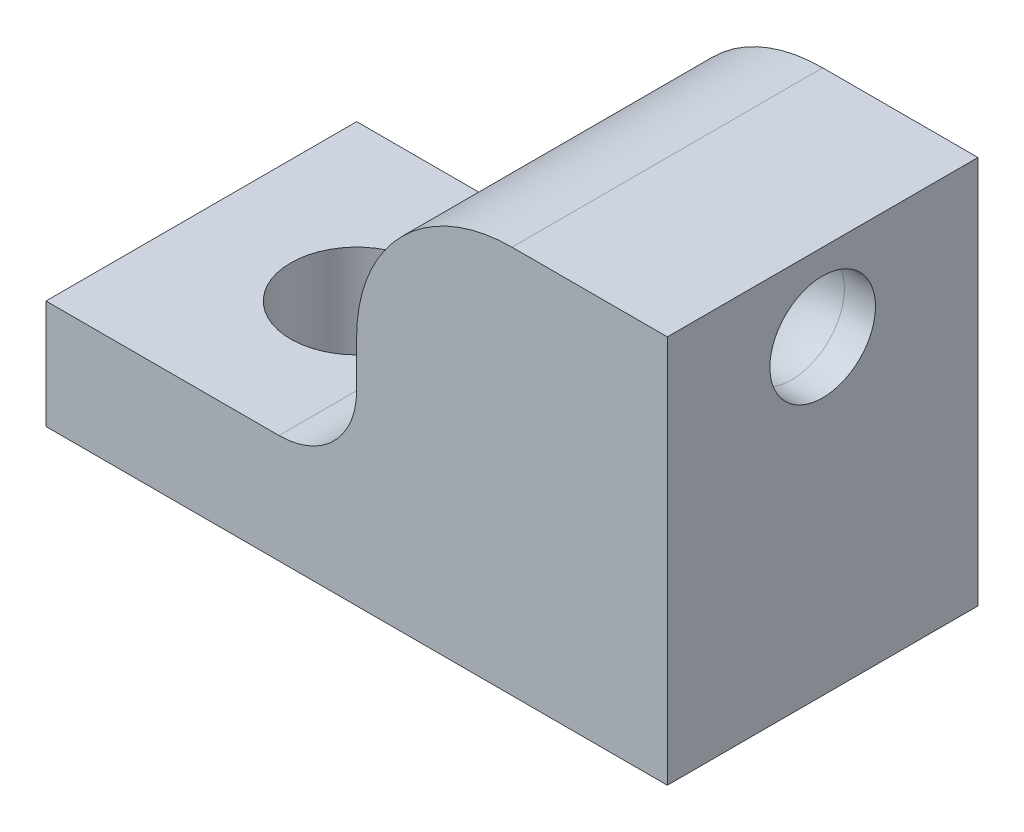
ISO-10303-21;
HEADER;
FILE_DESCRIPTION(('STEP AP214'),'2;1');
FILE_NAME('part.step','',(''),(''),'','','');
FILE_SCHEMA(('AUTOMOTIVE_DESIGN { 1 0 10303 214 1 1 1 1 }'));
ENDSEC;
DATA;
#1=APPLICATION_CONTEXT('core data for automotive mechanical design processes');
#2=APPLICATION_PROTOCOL_DEFINITION('international standard','automotive_design',2000,#1);
#3=PRODUCT_CONTEXT('',#1,'mechanical');
#4=PRODUCT('Part','Part','',(#3));
#5=PRODUCT_RELATED_PRODUCT_CATEGORY('part','',(#4));
#6=PRODUCT_DEFINITION_FORMATION('','',#4);
#7=PRODUCT_DEFINITION_CONTEXT('part definition',#1,'design');
#8=PRODUCT_DEFINITION('design','',#6,#7);
#9=PRODUCT_DEFINITION_SHAPE('','',#8);
#10=(LENGTH_UNIT() NAMED_UNIT(*) SI_UNIT(.MILLI.,.METRE.));
#11=(NAMED_UNIT(*) PLANE_ANGLE_UNIT() SI_UNIT($,.RADIAN.));
#12=(NAMED_UNIT(*) SI_UNIT($,.STERADIAN.) SOLID_ANGLE_UNIT());
#13=UNCERTAINTY_MEASURE_WITH_UNIT(LENGTH_MEASURE(1.E-05),#10,'distance_accuracy_value','');
#14=(GEOMETRIC_REPRESENTATION_CONTEXT(3) GLOBAL_UNCERTAINTY_ASSIGNED_CONTEXT((#13)) GLOBAL_UNIT_ASSIGNED_CONTEXT((#10,
#11,#12)) REPRESENTATION_CONTEXT('',''));
#15=CARTESIAN_POINT('',(0.,0.,0.));
#16=DIRECTION('',(0.,0.,1.));
#17=DIRECTION('',(1.,0.,0.));
#18=AXIS2_PLACEMENT_3D('',#15,#16,#17);
#19=CARTESIAN_POINT('',(0.,0.,10.));
#20=DIRECTION('',(0.,0.,1.));
#21=DIRECTION('',(1.,0.,0.));
#22=AXIS2_PLACEMENT_3D('',#19,#20,#21);
#23=PLANE('',#22);
#24=DIRECTION('',(-1.,0.,0.));
#25=VECTOR('',#24,1.);
#26=CARTESIAN_POINT('',(20.,25.,10.));
#27=LINE('',#26,#25);
#28=CARTESIAN_POINT('',(20.,25.,10.));
#29=VERTEX_POINT('',#28);
#30=CARTESIAN_POINT('',(10.,25.,10.));
#31=VERTEX_POINT('',#30);
#32=EDGE_CURVE('E158',#29,#31,#27,.T.);
#33=ORIENTED_EDGE('',*,*,#32,.T.);
#34=CARTESIAN_POINT('',(10.,15.,10.));
#35=DIRECTION('',(0.,0.,1.));
#36=DIRECTION('',(1.,0.,0.));
#37=AXIS2_PLACEMENT_3D('',#34,#35,#36);
#38=CIRCLE('',#37,10.);
#39=CARTESIAN_POINT('',(0.,15.,10.));
#40=VERTEX_POINT('',#39);
#41=EDGE_CURVE('E12',#31,#40,#38,.T.);
#42=ORIENTED_EDGE('',*,*,#41,.T.);
#43=DIRECTION('',(0.,-1.,0.));
#44=VECTOR('',#43,1.);
#45=CARTESIAN_POINT('',(0.,25.,10.));
#46=LINE('',#45,#44);
#47=CARTESIAN_POINT('',(0.,12.,10.));
#48=VERTEX_POINT('',#47);
#49=EDGE_CURVE('E156',#40,#48,#46,.T.);
#50=ORIENTED_EDGE('',*,*,#49,.T.);
#51=CARTESIAN_POINT('',(-5.,12.,10.));
#52=DIRECTION('',(0.,0.,1.));
#53=DIRECTION('',(1.,0.,0.));
#54=AXIS2_PLACEMENT_3D('',#51,#52,#53);
#55=CIRCLE('',#54,5.);
#56=CARTESIAN_POINT('',(-5.,7.,10.));
#57=VERTEX_POINT('',#56);
#58=EDGE_CURVE('E178',#48,#57,#55,.F.);
#59=ORIENTED_EDGE('',*,*,#58,.T.);
#60=DIRECTION('',(1.,0.,0.));
#61=VECTOR('',#60,1.);
#62=CARTESIAN_POINT('',(0.,7.,10.));
#63=LINE('',#62,#61);
#64=CARTESIAN_POINT('',(-20.,7.,10.));
#65=VERTEX_POINT('',#64);
#66=EDGE_CURVE('E135',#65,#57,#63,.T.);
#67=ORIENTED_EDGE('',*,*,#66,.F.);
#68=DIRECTION('',(0.,-1.,0.));
#69=VECTOR('',#68,1.);
#70=CARTESIAN_POINT('',(-20.,0.,10.));
#71=LINE('',#70,#69);
#72=CARTESIAN_POINT('',(-20.,0.,10.));
#73=VERTEX_POINT('',#72);
#74=EDGE_CURVE('E136',#65,#73,#71,.T.);
#75=ORIENTED_EDGE('',*,*,#74,.T.);
#76=DIRECTION('',(1.,0.,0.));
#77=VECTOR('',#76,1.);
#78=CARTESIAN_POINT('',(0.,0.,10.));
#79=LINE('',#78,#77);
#80=CARTESIAN_POINT('',(20.,0.,10.));
#81=VERTEX_POINT('',#80);
#82=EDGE_CURVE('E124',#73,#81,#79,.T.);
#83=ORIENTED_EDGE('',*,*,#82,.T.);
#84=DIRECTION('',(0.,-1.,0.));
#85=VECTOR('',#84,1.);
#86=CARTESIAN_POINT('',(20.,25.,10.));
#87=LINE('',#86,#85);
#88=EDGE_CURVE('E161',#29,#81,#87,.T.);
#89=ORIENTED_EDGE('',*,*,#88,.F.);
#90=EDGE_LOOP('',(#33,#42,#50,#59,#67,#75,#83,#89));
#91=FACE_BOUND('',#90,.T.);
#92=ADVANCED_FACE('F59',(#91),#23,.T.);
#93=CARTESIAN_POINT('',(-20.,0.,10.));
#94=DIRECTION('',(1.,0.,0.));
#95=DIRECTION('',(0.,0.,-1.));
#96=AXIS2_PLACEMENT_3D('',#93,#94,#95);
#97=PLANE('',#96);
#98=DIRECTION('',(0.,-1.,0.));
#99=VECTOR('',#98,1.);
#100=CARTESIAN_POINT('',(-20.,0.,-10.));
#101=LINE('',#100,#99);
#102=CARTESIAN_POINT('',(-20.,7.,-10.));
#103=VERTEX_POINT('',#102);
#104=CARTESIAN_POINT('',(-20.,0.,-10.));
#105=VERTEX_POINT('',#104);
#106=EDGE_CURVE('E146',#103,#105,#101,.T.);
#107=ORIENTED_EDGE('',*,*,#106,.T.);
#108=DIRECTION('',(0.,0.,-1.));
#109=VECTOR('',#108,1.);
#110=CARTESIAN_POINT('',(-20.,0.,10.));
#111=LINE('',#110,#109);
#112=EDGE_CURVE('E128',#73,#105,#111,.T.);
#113=ORIENTED_EDGE('',*,*,#112,.F.);
#114=ORIENTED_EDGE('',*,*,#74,.F.);
#115=DIRECTION('',(0.,0.,-1.));
#116=VECTOR('',#115,1.);
#117=CARTESIAN_POINT('',(-20.,7.,10.));
#118=LINE('',#117,#116);
#119=EDGE_CURVE('E148',#65,#103,#118,.T.);
#120=ORIENTED_EDGE('',*,*,#119,.T.);
#121=EDGE_LOOP('',(#107,#113,#114,#120));
#122=FACE_BOUND('',#121,.T.);
#123=ADVANCED_FACE('F144',(#122),#97,.F.);
#124=CARTESIAN_POINT('',(0.,0.,-10.));
#125=DIRECTION('',(0.,0.,1.));
#126=DIRECTION('',(1.,0.,0.));
#127=AXIS2_PLACEMENT_3D('',#124,#125,#126);
#128=PLANE('',#127);
#129=DIRECTION('',(0.,-1.,0.));
#130=VECTOR('',#129,1.);
#131=CARTESIAN_POINT('',(0.,25.,-10.));
#132=LINE('',#131,#130);
#133=CARTESIAN_POINT('',(0.,15.,-10.));
#134=VERTEX_POINT('',#133);
#135=CARTESIAN_POINT('',(0.,12.,-10.));
#136=VERTEX_POINT('',#135);
#137=EDGE_CURVE('E164',#134,#136,#132,.T.);
#138=ORIENTED_EDGE('',*,*,#137,.F.);
#139=CARTESIAN_POINT('',(10.,15.,-10.));
#140=DIRECTION('',(0.,0.,1.));
#141=DIRECTION('',(1.,0.,0.));
#142=AXIS2_PLACEMENT_3D('',#139,#140,#141);
#143=CIRCLE('',#142,10.);
#144=CARTESIAN_POINT('',(10.,25.,-10.));
#145=VERTEX_POINT('',#144);
#146=EDGE_CURVE('E81',#134,#145,#143,.F.);
#147=ORIENTED_EDGE('',*,*,#146,.T.);
#148=DIRECTION('',(-1.,0.,0.));
#149=VECTOR('',#148,1.);
#150=CARTESIAN_POINT('',(20.,25.,-10.));
#151=LINE('',#150,#149);
#152=CARTESIAN_POINT('',(20.,25.,-10.));
#153=VERTEX_POINT('',#152);
#154=EDGE_CURVE('E166',#153,#145,#151,.T.);
#155=ORIENTED_EDGE('',*,*,#154,.F.);
#156=DIRECTION('',(0.,-1.,0.));
#157=VECTOR('',#156,1.);
#158=CARTESIAN_POINT('',(20.,25.,-10.));
#159=LINE('',#158,#157);
#160=CARTESIAN_POINT('',(20.,0.,-10.));
#161=VERTEX_POINT('',#160);
#162=EDGE_CURVE('E159',#153,#161,#159,.T.);
#163=ORIENTED_EDGE('',*,*,#162,.T.);
#164=DIRECTION('',(1.,0.,0.));
#165=VECTOR('',#164,1.);
#166=CARTESIAN_POINT('',(0.,0.,-10.));
#167=LINE('',#166,#165);
#168=EDGE_CURVE('E202',#105,#161,#167,.T.);
#169=ORIENTED_EDGE('',*,*,#168,.F.);
#170=ORIENTED_EDGE('',*,*,#106,.F.);
#171=DIRECTION('',(1.,0.,0.));
#172=VECTOR('',#171,1.);
#173=CARTESIAN_POINT('',(0.,7.,-10.));
#174=LINE('',#173,#172);
#175=CARTESIAN_POINT('',(-5.,7.,-10.));
#176=VERTEX_POINT('',#175);
#177=EDGE_CURVE('E142',#103,#176,#174,.T.);
#178=ORIENTED_EDGE('',*,*,#177,.T.);
#179=CARTESIAN_POINT('',(-5.,12.,-10.));
#180=DIRECTION('',(0.,0.,1.));
#181=DIRECTION('',(1.,0.,0.));
#182=AXIS2_PLACEMENT_3D('',#179,#180,#181);
#183=CIRCLE('',#182,5.);
#184=EDGE_CURVE('E175',#176,#136,#183,.T.);
#185=ORIENTED_EDGE('',*,*,#184,.T.);
#186=EDGE_LOOP('',(#138,#147,#155,#163,#169,#170,#178,#185));
#187=FACE_BOUND('',#186,.T.);
#188=ADVANCED_FACE('F189',(#187),#128,.F.);
#189=CARTESIAN_POINT('',(0.,7.,10.));
#190=DIRECTION('',(0.,1.,0.));
#191=DIRECTION('',(-1.,0.,0.));
#192=AXIS2_PLACEMENT_3D('',#189,#190,#191);
#193=PLANE('',#192);
#194=CARTESIAN_POINT('',(-10.,7.,0.));
#195=DIRECTION('',(0.,1.,0.));
#196=DIRECTION('',(-1.,0.,0.));
#197=AXIS2_PLACEMENT_3D('',#194,#195,#196);
#198=CIRCLE('',#197,4.25);
#199=CARTESIAN_POINT('',(-14.25,7.,0.));
#200=VERTEX_POINT('',#199);
#201=EDGE_CURVE('E251',#200,#200,#198,.T.);
#202=ORIENTED_EDGE('',*,*,#201,.F.);
#203=EDGE_LOOP('',(#202));
#204=FACE_BOUND('',#203,.T.);
#205=ORIENTED_EDGE('',*,*,#66,.T.);
#206=DIRECTION('',(0.,0.,-1.));
#207=VECTOR('',#206,1.);
#208=CARTESIAN_POINT('',(-5.,7.,10.));
#209=LINE('',#208,#207);
#210=EDGE_CURVE('E147',#57,#176,#209,.T.);
#211=ORIENTED_EDGE('',*,*,#210,.T.);
#212=ORIENTED_EDGE('',*,*,#177,.F.);
#213=ORIENTED_EDGE('',*,*,#119,.F.);
#214=EDGE_LOOP('',(#205,#211,#212,#213));
#215=FACE_BOUND('',#214,.T.);
#216=ADVANCED_FACE('F198',(#204,#215),#193,.T.);
#217=CARTESIAN_POINT('',(0.,0.,10.));
#218=DIRECTION('',(0.,1.,0.));
#219=DIRECTION('',(0.,0.,1.));
#220=AXIS2_PLACEMENT_3D('',#217,#218,#219);
#221=PLANE('',#220);
#222=CARTESIAN_POINT('',(9.99999999999999,0.,0.));
#223=DIRECTION('',(0.,1.,0.));
#224=DIRECTION('',(0.,0.,1.));
#225=AXIS2_PLACEMENT_3D('',#222,#223,#224);
#226=CIRCLE('',#225,3.4);
#227=CARTESIAN_POINT('',(9.99999999999999,0.,3.4));
#228=VERTEX_POINT('',#227);
#229=EDGE_CURVE('E262',#228,#228,#226,.T.);
#230=ORIENTED_EDGE('',*,*,#229,.T.);
#231=EDGE_LOOP('',(#230));
#232=FACE_BOUND('',#231,.T.);
#233=CARTESIAN_POINT('',(-10.,0.,0.));
#234=DIRECTION('',(0.,1.,0.));
#235=DIRECTION('',(-1.,0.,0.));
#236=AXIS2_PLACEMENT_3D('',#233,#234,#235);
#237=CIRCLE('',#236,4.25);
#238=CARTESIAN_POINT('',(-14.25,0.,0.));
#239=VERTEX_POINT('',#238);
#240=EDGE_CURVE('E167',#239,#239,#237,.T.);
#241=ORIENTED_EDGE('',*,*,#240,.T.);
#242=EDGE_LOOP('',(#241));
#243=FACE_BOUND('',#242,.T.);
#244=ORIENTED_EDGE('',*,*,#168,.T.);
#245=DIRECTION('',(0.,0.,-1.));
#246=VECTOR('',#245,1.);
#247=CARTESIAN_POINT('',(20.,0.,10.));
#248=LINE('',#247,#246);
#249=EDGE_CURVE('E131',#81,#161,#248,.T.);
#250=ORIENTED_EDGE('',*,*,#249,.F.);
#251=ORIENTED_EDGE('',*,*,#82,.F.);
#252=ORIENTED_EDGE('',*,*,#112,.T.);
#253=EDGE_LOOP('',(#244,#250,#251,#252));
#254=FACE_BOUND('',#253,.T.);
#255=ADVANCED_FACE('F126',(#232,#243,#254),#221,.F.);
#256=CARTESIAN_POINT('',(20.,25.,10.));
#257=DIRECTION('',(1.,0.,0.));
#258=DIRECTION('',(0.,1.,0.));
#259=AXIS2_PLACEMENT_3D('',#256,#257,#258);
#260=PLANE('',#259);
#261=CARTESIAN_POINT('',(20.,20.,0.));
#262=DIRECTION('',(1.,0.,0.));
#263=DIRECTION('',(0.,1.,0.));
#264=AXIS2_PLACEMENT_3D('',#261,#262,#263);
#265=CIRCLE('',#264,3.4);
#266=CARTESIAN_POINT('',(20.,23.4,0.));
#267=VERTEX_POINT('',#266);
#268=EDGE_CURVE('E252',#267,#267,#265,.T.);
#269=ORIENTED_EDGE('',*,*,#268,.F.);
#270=EDGE_LOOP('',(#269));
#271=FACE_BOUND('',#270,.T.);
#272=ORIENTED_EDGE('',*,*,#162,.F.);
#273=DIRECTION('',(0.,0.,-1.));
#274=VECTOR('',#273,1.);
#275=CARTESIAN_POINT('',(20.,25.,10.));
#276=LINE('',#275,#274);
#277=EDGE_CURVE('E163',#29,#153,#276,.T.);
#278=ORIENTED_EDGE('',*,*,#277,.F.);
#279=ORIENTED_EDGE('',*,*,#88,.T.);
#280=ORIENTED_EDGE('',*,*,#249,.T.);
#281=EDGE_LOOP('',(#272,#278,#279,#280));
#282=FACE_BOUND('',#281,.T.);
#283=ADVANCED_FACE('F205',(#271,#282),#260,.T.);
#284=CARTESIAN_POINT('',(20.,25.,10.));
#285=DIRECTION('',(0.,-1.,0.));
#286=DIRECTION('',(1.,0.,0.));
#287=AXIS2_PLACEMENT_3D('',#284,#285,#286);
#288=PLANE('',#287);
#289=ORIENTED_EDGE('',*,*,#154,.T.);
#290=DIRECTION('',(0.,0.,-1.));
#291=VECTOR('',#290,1.);
#292=CARTESIAN_POINT('',(10.,25.,10.));
#293=LINE('',#292,#291);
#294=EDGE_CURVE('E67',#145,#31,#293,.F.);
#295=ORIENTED_EDGE('',*,*,#294,.T.);
#296=ORIENTED_EDGE('',*,*,#32,.F.);
#297=ORIENTED_EDGE('',*,*,#277,.T.);
#298=EDGE_LOOP('',(#289,#295,#296,#297));
#299=FACE_BOUND('',#298,.T.);
#300=ADVANCED_FACE('F206',(#299),#288,.F.);
#301=CARTESIAN_POINT('',(0.,25.,10.));
#302=DIRECTION('',(1.,0.,0.));
#303=DIRECTION('',(0.,1.,0.));
#304=AXIS2_PLACEMENT_3D('',#301,#302,#303);
#305=PLANE('',#304);
#306=ORIENTED_EDGE('',*,*,#49,.F.);
#307=DIRECTION('',(0.,0.,-1.));
#308=VECTOR('',#307,1.);
#309=CARTESIAN_POINT('',(0.,15.,10.));
#310=LINE('',#309,#308);
#311=EDGE_CURVE('E180',#40,#134,#310,.T.);
#312=ORIENTED_EDGE('',*,*,#311,.T.);
#313=ORIENTED_EDGE('',*,*,#137,.T.);
#314=DIRECTION('',(0.,0.,-1.));
#315=VECTOR('',#314,1.);
#316=CARTESIAN_POINT('',(0.,12.,10.));
#317=LINE('',#316,#315);
#318=EDGE_CURVE('E151',#136,#48,#317,.F.);
#319=ORIENTED_EDGE('',*,*,#318,.T.);
#320=EDGE_LOOP('',(#306,#312,#313,#319));
#321=FACE_BOUND('',#320,.T.);
#322=ADVANCED_FACE('F186',(#321),#305,.F.);
#323=CARTESIAN_POINT('',(-10.,0.,0.));
#324=DIRECTION('',(0.,1.,0.));
#325=DIRECTION('',(-1.,0.,0.));
#326=AXIS2_PLACEMENT_3D('',#323,#324,#325);
#327=CYLINDRICAL_SURFACE('',#326,4.25);
#328=ORIENTED_EDGE('',*,*,#240,.F.);
#329=EDGE_LOOP('',(#328));
#330=FACE_BOUND('',#329,.T.);
#331=ORIENTED_EDGE('',*,*,#201,.T.);
#332=EDGE_LOOP('',(#331));
#333=FACE_BOUND('',#332,.T.);
#334=ADVANCED_FACE('F221',(#330,#333),#327,.F.);
#335=CARTESIAN_POINT('',(18.,20.,0.));
#336=DIRECTION('',(1.,0.,0.));
#337=DIRECTION('',(0.,0.,-1.));
#338=AXIS2_PLACEMENT_3D('',#335,#336,#337);
#339=CYLINDRICAL_SURFACE('',#338,3.4);
#340=CARTESIAN_POINT('',(18.,20.,0.));
#341=DIRECTION('',(-1.,0.,0.));
#342=DIRECTION('',(0.,-1.,0.));
#343=AXIS2_PLACEMENT_3D('',#340,#341,#342);
#344=CIRCLE('',#343,3.4);
#345=CARTESIAN_POINT('',(18.,23.4,0.));
#346=VERTEX_POINT('',#345);
#347=EDGE_CURVE('E256',#346,#346,#344,.T.);
#348=ORIENTED_EDGE('',*,*,#347,.T.);
#349=EDGE_LOOP('',(#348));
#350=FACE_BOUND('',#349,.T.);
#351=ORIENTED_EDGE('',*,*,#268,.T.);
#352=EDGE_LOOP('',(#351));
#353=FACE_BOUND('',#352,.T.);
#354=ADVANCED_FACE('F240',(#350,#353),#339,.F.);
#355=CARTESIAN_POINT('',(9.99999999999999,-0.999999999999999,0.));
#356=DIRECTION('',(0.,1.,0.));
#357=DIRECTION('',(-1.,0.,0.));
#358=AXIS2_PLACEMENT_3D('',#355,#356,#357);
#359=CYLINDRICAL_SURFACE('',#358,3.4);
#360=ORIENTED_EDGE('',*,*,#229,.F.);
#361=EDGE_LOOP('',(#360));
#362=FACE_BOUND('',#361,.T.);
#363=CARTESIAN_POINT('',(9.99999999999996,12.,0.));
#364=DIRECTION('',(0.,-1.,0.));
#365=DIRECTION('',(1.,0.,0.));
#366=AXIS2_PLACEMENT_3D('',#363,#364,#365);
#367=CIRCLE('',#366,3.4);
#368=CARTESIAN_POINT('',(6.59999999999996,12.,0.));
#369=VERTEX_POINT('',#368);
#370=EDGE_CURVE('E259',#369,#369,#367,.T.);
#371=ORIENTED_EDGE('',*,*,#370,.F.);
#372=EDGE_LOOP('',(#371));
#373=FACE_BOUND('',#372,.T.);
#374=ADVANCED_FACE('F212',(#362,#373),#359,.F.);
#375=CARTESIAN_POINT('',(18.,12.,0.));
#376=DIRECTION('',(0.,0.,-1.));
#377=DIRECTION('',(-1.,0.,0.));
#378=AXIS2_PLACEMENT_3D('',#375,#376,#377);
#379=TOROIDAL_SURFACE('',#378,8.00000000000003,3.4);
#380=CARTESIAN_POINT('',(18.,12.,0.));
#381=DIRECTION('',(0.,0.,-1.));
#382=DIRECTION('',(-1.,0.,0.));
#383=AXIS2_PLACEMENT_3D('',#380,#381,#382);
#384=CIRCLE('',#383,11.4);
#385=EDGE_CURVE('',#369,#346,#384,.T.);
#386=ORIENTED_EDGE('',*,*,#370,.T.);
#387=ORIENTED_EDGE('',*,*,#347,.F.);
#388=ORIENTED_EDGE('',*,*,#385,.T.);
#389=ORIENTED_EDGE('',*,*,#385,.F.);
#390=EDGE_LOOP('',(#386,#388,#387,#389));
#391=FACE_BOUND('',#390,.T.);
#392=ADVANCED_FACE('F211',(#391),#379,.F.);
#393=CARTESIAN_POINT('',(-5.,12.,10.));
#394=DIRECTION('',(0.,0.,-1.));
#395=DIRECTION('',(-1.,0.,0.));
#396=AXIS2_PLACEMENT_3D('',#393,#394,#395);
#397=CYLINDRICAL_SURFACE('',#396,5.);
#398=ORIENTED_EDGE('',*,*,#58,.F.);
#399=ORIENTED_EDGE('',*,*,#318,.F.);
#400=ORIENTED_EDGE('',*,*,#184,.F.);
#401=ORIENTED_EDGE('',*,*,#210,.F.);
#402=EDGE_LOOP('',(#398,#399,#400,#401));
#403=FACE_BOUND('',#402,.T.);
#404=ADVANCED_FACE('F196',(#403),#397,.F.);
#405=CARTESIAN_POINT('',(10.,15.,10.));
#406=DIRECTION('',(0.,0.,-1.));
#407=DIRECTION('',(-1.,0.,0.));
#408=AXIS2_PLACEMENT_3D('',#405,#406,#407);
#409=CYLINDRICAL_SURFACE('',#408,10.);
#410=ORIENTED_EDGE('',*,*,#41,.F.);
#411=ORIENTED_EDGE('',*,*,#294,.F.);
#412=ORIENTED_EDGE('',*,*,#146,.F.);
#413=ORIENTED_EDGE('',*,*,#311,.F.);
#414=EDGE_LOOP('',(#410,#411,#412,#413));
#415=FACE_BOUND('',#414,.T.);
#416=ADVANCED_FACE('F61',(#415),#409,.T.);
#417=CLOSED_SHELL('',(#92,#123,#188,#216,#255,#283,#300,#322,#334,#354,#374,#392,#404,#416));
#418=MANIFOLD_SOLID_BREP('B2',#417);
#419=ADVANCED_BREP_SHAPE_REPRESENTATION('',(#18,#418),#14);
#420=SHAPE_DEFINITION_REPRESENTATION(#9,#419);
ENDSEC;
END-ISO-10303-21;
